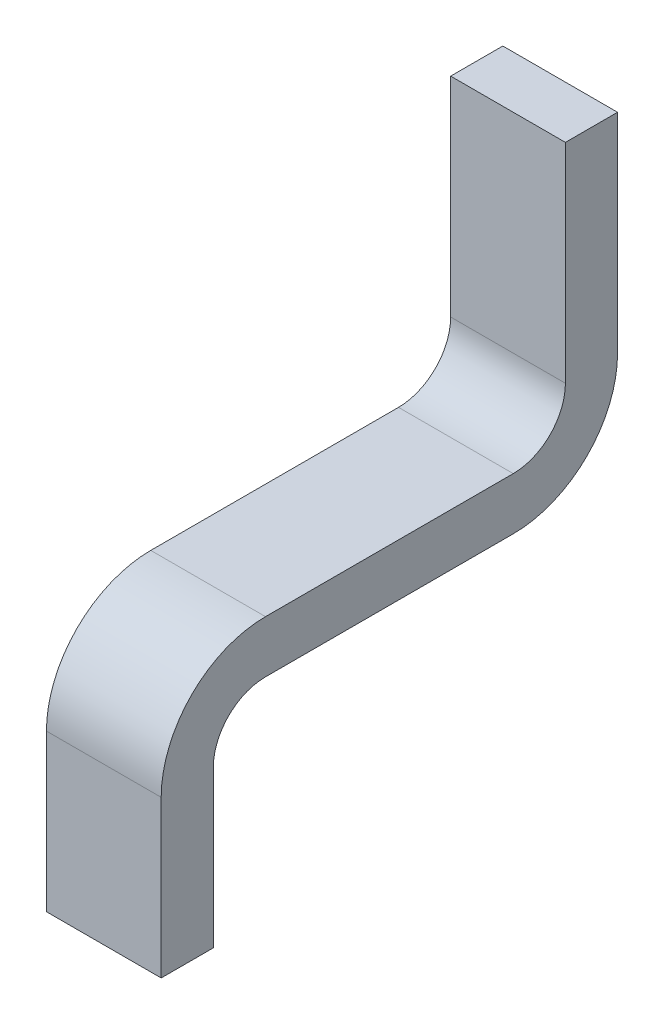
ISO-10303-21;
HEADER;
FILE_DESCRIPTION(('STEP AP214'),'2;1');
FILE_NAME('part.step','',(''),(''),'','','');
FILE_SCHEMA(('AUTOMOTIVE_DESIGN { 1 0 10303 214 1 1 1 1 }'));
ENDSEC;
DATA;
#1=APPLICATION_CONTEXT('core data for automotive mechanical design processes');
#2=APPLICATION_PROTOCOL_DEFINITION('international standard','automotive_design',2000,#1);
#3=PRODUCT_CONTEXT('',#1,'mechanical');
#4=PRODUCT('Part','Part','',(#3));
#5=PRODUCT_RELATED_PRODUCT_CATEGORY('part','',(#4));
#6=PRODUCT_DEFINITION_FORMATION('','',#4);
#7=PRODUCT_DEFINITION_CONTEXT('part definition',#1,'design');
#8=PRODUCT_DEFINITION('design','',#6,#7);
#9=PRODUCT_DEFINITION_SHAPE('','',#8);
#10=(LENGTH_UNIT() NAMED_UNIT(*) SI_UNIT(.MILLI.,.METRE.));
#11=(NAMED_UNIT(*) PLANE_ANGLE_UNIT() SI_UNIT($,.RADIAN.));
#12=(NAMED_UNIT(*) SI_UNIT($,.STERADIAN.) SOLID_ANGLE_UNIT());
#13=UNCERTAINTY_MEASURE_WITH_UNIT(LENGTH_MEASURE(1.E-05),#10,'distance_accuracy_value','');
#14=(GEOMETRIC_REPRESENTATION_CONTEXT(3) GLOBAL_UNCERTAINTY_ASSIGNED_CONTEXT((#13)) GLOBAL_UNIT_ASSIGNED_CONTEXT((#10,
#11,#12)) REPRESENTATION_CONTEXT('',''));
#15=CARTESIAN_POINT('',(0.,0.,0.));
#16=DIRECTION('',(0.,0.,1.));
#17=DIRECTION('',(1.,0.,0.));
#18=AXIS2_PLACEMENT_3D('',#15,#16,#17);
#19=CARTESIAN_POINT('',(0.86,4.,0.675));
#20=DIRECTION('',(-1.,0.,0.));
#21=DIRECTION('',(0.,-1.,0.));
#22=AXIS2_PLACEMENT_3D('',#19,#20,#21);
#23=PLANE('',#22);
#24=CARTESIAN_POINT('',(0.860000000000001,3.8,0.675));
#25=DIRECTION('',(1.,0.,0.));
#26=DIRECTION('',(0.,1.,0.));
#27=AXIS2_PLACEMENT_3D('',#24,#25,#26);
#28=CIRCLE('',#27,0.2);
#29=CARTESIAN_POINT('',(0.860000000000001,3.8,0.875));
#30=VERTEX_POINT('',#29);
#31=CARTESIAN_POINT('',(0.86,4.,0.675));
#32=VERTEX_POINT('',#31);
#33=EDGE_CURVE('E150',#30,#32,#28,.F.);
#34=ORIENTED_EDGE('',*,*,#33,.F.);
#35=DIRECTION('',(0.,1.,0.));
#36=VECTOR('',#35,1.);
#37=CARTESIAN_POINT('',(0.86,3.50000000000001,0.875));
#38=LINE('',#37,#36);
#39=CARTESIAN_POINT('',(0.86,3.50000000000001,0.875));
#40=VERTEX_POINT('',#39);
#41=EDGE_CURVE('E147',#30,#40,#38,.F.);
#42=ORIENTED_EDGE('',*,*,#41,.T.);
#43=DIRECTION('',(0.,0.,1.));
#44=VECTOR('',#43,1.);
#45=CARTESIAN_POINT('',(0.86,3.50000000000001,0.775));
#46=LINE('',#45,#44);
#47=CARTESIAN_POINT('',(0.86,3.50000000000001,0.775));
#48=VERTEX_POINT('',#47);
#49=EDGE_CURVE('E141',#48,#40,#46,.T.);
#50=ORIENTED_EDGE('',*,*,#49,.F.);
#51=DIRECTION('',(0.,1.,0.));
#52=VECTOR('',#51,1.);
#53=CARTESIAN_POINT('',(0.86,3.50000000000001,0.775));
#54=LINE('',#53,#52);
#55=CARTESIAN_POINT('',(0.860000000000001,3.8,0.775));
#56=VERTEX_POINT('',#55);
#57=EDGE_CURVE('E115',#48,#56,#54,.T.);
#58=ORIENTED_EDGE('',*,*,#57,.T.);
#59=CARTESIAN_POINT('',(0.860000000000001,3.8,0.675));
#60=DIRECTION('',(1.,0.,0.));
#61=DIRECTION('',(0.,1.,0.));
#62=AXIS2_PLACEMENT_3D('',#59,#60,#61);
#63=CIRCLE('',#62,0.1);
#64=CARTESIAN_POINT('',(0.860000000000001,3.90000000000001,0.675));
#65=VERTEX_POINT('',#64);
#66=EDGE_CURVE('E215',#56,#65,#63,.F.);
#67=ORIENTED_EDGE('',*,*,#66,.T.);
#68=DIRECTION('',(0.,0.,1.));
#69=VECTOR('',#68,1.);
#70=CARTESIAN_POINT('',(0.860000000000001,3.90000000000001,0.675));
#71=LINE('',#70,#69);
#72=CARTESIAN_POINT('',(0.860000000000001,3.90000000000001,0.2));
#73=VERTEX_POINT('',#72);
#74=EDGE_CURVE('E181',#65,#73,#71,.F.);
#75=ORIENTED_EDGE('',*,*,#74,.T.);
#76=CARTESIAN_POINT('',(0.86,4.1,0.2));
#77=DIRECTION('',(-1.,0.,0.));
#78=DIRECTION('',(0.,-1.,0.));
#79=AXIS2_PLACEMENT_3D('',#76,#77,#78);
#80=CIRCLE('',#79,0.2);
#81=CARTESIAN_POINT('',(0.86,4.1,0.));
#82=VERTEX_POINT('',#81);
#83=EDGE_CURVE('E20',#82,#73,#80,.T.);
#84=ORIENTED_EDGE('',*,*,#83,.F.);
#85=DIRECTION('',(0.,1.,0.));
#86=VECTOR('',#85,1.);
#87=CARTESIAN_POINT('',(0.86,4.1,0.));
#88=LINE('',#87,#86);
#89=CARTESIAN_POINT('',(0.86,4.5,0.));
#90=VERTEX_POINT('',#89);
#91=EDGE_CURVE('E91',#82,#90,#88,.T.);
#92=ORIENTED_EDGE('',*,*,#91,.T.);
#93=DIRECTION('',(0.,0.,1.));
#94=VECTOR('',#93,1.);
#95=CARTESIAN_POINT('',(0.86,4.5,0.));
#96=LINE('',#95,#94);
#97=CARTESIAN_POINT('',(0.86,4.5,0.1));
#98=VERTEX_POINT('',#97);
#99=EDGE_CURVE('E163',#90,#98,#96,.T.);
#100=ORIENTED_EDGE('',*,*,#99,.T.);
#101=DIRECTION('',(0.,1.,0.));
#102=VECTOR('',#101,1.);
#103=CARTESIAN_POINT('',(0.86,4.1,0.1));
#104=LINE('',#103,#102);
#105=CARTESIAN_POINT('',(0.86,4.1,0.1));
#106=VERTEX_POINT('',#105);
#107=EDGE_CURVE('E159',#98,#106,#104,.F.);
#108=ORIENTED_EDGE('',*,*,#107,.T.);
#109=CARTESIAN_POINT('',(0.86,4.1,0.2));
#110=DIRECTION('',(-1.,0.,0.));
#111=DIRECTION('',(0.,-1.,0.));
#112=AXIS2_PLACEMENT_3D('',#109,#110,#111);
#113=CIRCLE('',#112,0.1);
#114=CARTESIAN_POINT('',(0.86,4.,0.2));
#115=VERTEX_POINT('',#114);
#116=EDGE_CURVE('E155',#106,#115,#113,.T.);
#117=ORIENTED_EDGE('',*,*,#116,.T.);
#118=DIRECTION('',(0.,0.,1.));
#119=VECTOR('',#118,1.);
#120=CARTESIAN_POINT('',(0.86,4.,0.675));
#121=LINE('',#120,#119);
#122=EDGE_CURVE('E154',#115,#32,#121,.T.);
#123=ORIENTED_EDGE('',*,*,#122,.T.);
#124=EDGE_LOOP('',(#34,#42,#50,#58,#67,#75,#84,#92,#100,#108,#117,#123));
#125=FACE_BOUND('',#124,.T.);
#126=ADVANCED_FACE('F17',(#125),#23,.F.);
#127=CARTESIAN_POINT('',(0.86,4.1,0.2));
#128=DIRECTION('',(-1.,0.,0.));
#129=DIRECTION('',(0.,-1.,0.));
#130=AXIS2_PLACEMENT_3D('',#127,#128,#129);
#131=CYLINDRICAL_SURFACE('',#130,0.2);
#132=CARTESIAN_POINT('',(0.64,4.1,0.2));
#133=DIRECTION('',(-1.,0.,0.));
#134=DIRECTION('',(0.,-1.,0.));
#135=AXIS2_PLACEMENT_3D('',#132,#133,#134);
#136=CIRCLE('',#135,0.2);
#137=CARTESIAN_POINT('',(0.640000000000001,3.90000000000001,0.2));
#138=VERTEX_POINT('',#137);
#139=CARTESIAN_POINT('',(0.64,4.1,0.));
#140=VERTEX_POINT('',#139);
#141=EDGE_CURVE('E183',#138,#140,#136,.F.);
#142=ORIENTED_EDGE('',*,*,#141,.T.);
#143=DIRECTION('',(1.,0.,0.));
#144=VECTOR('',#143,1.);
#145=CARTESIAN_POINT('',(0.86,4.1,0.));
#146=LINE('',#145,#144);
#147=EDGE_CURVE('E178',#140,#82,#146,.T.);
#148=ORIENTED_EDGE('',*,*,#147,.T.);
#149=ORIENTED_EDGE('',*,*,#83,.T.);
#150=DIRECTION('',(-1.,0.,0.));
#151=VECTOR('',#150,1.);
#152=CARTESIAN_POINT('',(0.860000000000001,3.90000000000001,0.2));
#153=LINE('',#152,#151);
#154=EDGE_CURVE('E217',#73,#138,#153,.T.);
#155=ORIENTED_EDGE('',*,*,#154,.T.);
#156=EDGE_LOOP('',(#142,#148,#149,#155));
#157=FACE_BOUND('',#156,.T.);
#158=ADVANCED_FACE('F254',(#157),#131,.T.);
#159=CARTESIAN_POINT('',(0.86,4.1,0.));
#160=DIRECTION('',(0.,0.,1.));
#161=DIRECTION('',(1.,0.,0.));
#162=AXIS2_PLACEMENT_3D('',#159,#160,#161);
#163=PLANE('',#162);
#164=ORIENTED_EDGE('',*,*,#147,.F.);
#165=DIRECTION('',(0.,1.,0.));
#166=VECTOR('',#165,1.);
#167=CARTESIAN_POINT('',(0.640000000000001,3.90000000000001,0.));
#168=LINE('',#167,#166);
#169=CARTESIAN_POINT('',(0.64,4.5,0.));
#170=VERTEX_POINT('',#169);
#171=EDGE_CURVE('E170',#140,#170,#168,.T.);
#172=ORIENTED_EDGE('',*,*,#171,.T.);
#173=DIRECTION('',(1.,0.,0.));
#174=VECTOR('',#173,1.);
#175=CARTESIAN_POINT('',(0.86,4.5,0.));
#176=LINE('',#175,#174);
#177=EDGE_CURVE('E173',#170,#90,#176,.T.);
#178=ORIENTED_EDGE('',*,*,#177,.T.);
#179=ORIENTED_EDGE('',*,*,#91,.F.);
#180=EDGE_LOOP('',(#164,#172,#178,#179));
#181=FACE_BOUND('',#180,.T.);
#182=ADVANCED_FACE('F257',(#181),#163,.F.);
#183=CARTESIAN_POINT('',(0.86,4.5,0.));
#184=DIRECTION('',(0.,-1.,0.));
#185=DIRECTION('',(1.,0.,0.));
#186=AXIS2_PLACEMENT_3D('',#183,#184,#185);
#187=PLANE('',#186);
#188=DIRECTION('',(-1.,0.,0.));
#189=VECTOR('',#188,1.);
#190=CARTESIAN_POINT('',(0.64,4.5,0.1));
#191=LINE('',#190,#189);
#192=CARTESIAN_POINT('',(0.64,4.5,0.1));
#193=VERTEX_POINT('',#192);
#194=EDGE_CURVE('E160',#193,#98,#191,.F.);
#195=ORIENTED_EDGE('',*,*,#194,.T.);
#196=ORIENTED_EDGE('',*,*,#99,.F.);
#197=ORIENTED_EDGE('',*,*,#177,.F.);
#198=DIRECTION('',(0.,0.,1.));
#199=VECTOR('',#198,1.);
#200=CARTESIAN_POINT('',(0.64,4.5,0.675));
#201=LINE('',#200,#199);
#202=EDGE_CURVE('E166',#170,#193,#201,.T.);
#203=ORIENTED_EDGE('',*,*,#202,.T.);
#204=EDGE_LOOP('',(#195,#196,#197,#203));
#205=FACE_BOUND('',#204,.T.);
#206=ADVANCED_FACE('F259',(#205),#187,.F.);
#207=CARTESIAN_POINT('',(0.64,4.1,0.1));
#208=DIRECTION('',(0.,0.,-1.));
#209=DIRECTION('',(-1.,0.,0.));
#210=AXIS2_PLACEMENT_3D('',#207,#208,#209);
#211=PLANE('',#210);
#212=DIRECTION('',(-1.,0.,0.));
#213=VECTOR('',#212,1.);
#214=CARTESIAN_POINT('',(0.64,4.1,0.1));
#215=LINE('',#214,#213);
#216=CARTESIAN_POINT('',(0.64,4.1,0.1));
#217=VERTEX_POINT('',#216);
#218=EDGE_CURVE('E156',#217,#106,#215,.F.);
#219=ORIENTED_EDGE('',*,*,#218,.T.);
#220=ORIENTED_EDGE('',*,*,#107,.F.);
#221=ORIENTED_EDGE('',*,*,#194,.F.);
#222=DIRECTION('',(0.,1.,0.));
#223=VECTOR('',#222,1.);
#224=CARTESIAN_POINT('',(0.640000000000001,3.90000000000001,0.1));
#225=LINE('',#224,#223);
#226=EDGE_CURVE('E169',#193,#217,#225,.F.);
#227=ORIENTED_EDGE('',*,*,#226,.T.);
#228=EDGE_LOOP('',(#219,#220,#221,#227));
#229=FACE_BOUND('',#228,.T.);
#230=ADVANCED_FACE('F234',(#229),#211,.F.);
#231=CARTESIAN_POINT('',(0.64,4.1,0.2));
#232=DIRECTION('',(-1.,0.,0.));
#233=DIRECTION('',(0.,-1.,0.));
#234=AXIS2_PLACEMENT_3D('',#231,#232,#233);
#235=CYLINDRICAL_SURFACE('',#234,0.1);
#236=DIRECTION('',(1.,0.,0.));
#237=VECTOR('',#236,1.);
#238=CARTESIAN_POINT('',(0.64,4.,0.2));
#239=LINE('',#238,#237);
#240=CARTESIAN_POINT('',(0.64,4.,0.2));
#241=VERTEX_POINT('',#240);
#242=EDGE_CURVE('E151',#241,#115,#239,.T.);
#243=ORIENTED_EDGE('',*,*,#242,.T.);
#244=ORIENTED_EDGE('',*,*,#116,.F.);
#245=ORIENTED_EDGE('',*,*,#218,.F.);
#246=CARTESIAN_POINT('',(0.64,4.1,0.2));
#247=DIRECTION('',(-1.,0.,0.));
#248=DIRECTION('',(0.,-1.,0.));
#249=AXIS2_PLACEMENT_3D('',#246,#247,#248);
#250=CIRCLE('',#249,0.1);
#251=EDGE_CURVE('E210',#217,#241,#250,.T.);
#252=ORIENTED_EDGE('',*,*,#251,.T.);
#253=EDGE_LOOP('',(#243,#244,#245,#252));
#254=FACE_BOUND('',#253,.T.);
#255=ADVANCED_FACE('F227',(#254),#235,.F.);
#256=CARTESIAN_POINT('',(0.64,4.,0.675));
#257=DIRECTION('',(0.,-1.,0.));
#258=DIRECTION('',(1.,0.,0.));
#259=AXIS2_PLACEMENT_3D('',#256,#257,#258);
#260=PLANE('',#259);
#261=DIRECTION('',(1.,0.,0.));
#262=VECTOR('',#261,1.);
#263=CARTESIAN_POINT('',(0.64,4.,0.675));
#264=LINE('',#263,#262);
#265=CARTESIAN_POINT('',(0.64,4.,0.675));
#266=VERTEX_POINT('',#265);
#267=EDGE_CURVE('E148',#32,#266,#264,.F.);
#268=ORIENTED_EDGE('',*,*,#267,.F.);
#269=ORIENTED_EDGE('',*,*,#122,.F.);
#270=ORIENTED_EDGE('',*,*,#242,.F.);
#271=DIRECTION('',(0.,0.,1.));
#272=VECTOR('',#271,1.);
#273=CARTESIAN_POINT('',(0.64,4.,0.675));
#274=LINE('',#273,#272);
#275=EDGE_CURVE('E209',#241,#266,#274,.T.);
#276=ORIENTED_EDGE('',*,*,#275,.T.);
#277=EDGE_LOOP('',(#268,#269,#270,#276));
#278=FACE_BOUND('',#277,.T.);
#279=ADVANCED_FACE('F224',(#278),#260,.F.);
#280=CARTESIAN_POINT('',(0.640000000000001,3.8,0.675));
#281=DIRECTION('',(1.,0.,0.));
#282=DIRECTION('',(0.,1.,0.));
#283=AXIS2_PLACEMENT_3D('',#280,#281,#282);
#284=CYLINDRICAL_SURFACE('',#283,0.2);
#285=ORIENTED_EDGE('',*,*,#33,.T.);
#286=ORIENTED_EDGE('',*,*,#267,.T.);
#287=CARTESIAN_POINT('',(0.640000000000001,3.8,0.675));
#288=DIRECTION('',(1.,0.,0.));
#289=DIRECTION('',(0.,1.,0.));
#290=AXIS2_PLACEMENT_3D('',#287,#288,#289);
#291=CIRCLE('',#290,0.2);
#292=CARTESIAN_POINT('',(0.640000000000001,3.8,0.875));
#293=VERTEX_POINT('',#292);
#294=EDGE_CURVE('E133',#266,#293,#291,.T.);
#295=ORIENTED_EDGE('',*,*,#294,.T.);
#296=DIRECTION('',(-1.,0.,0.));
#297=VECTOR('',#296,1.);
#298=CARTESIAN_POINT('',(0.640000000000001,3.8,0.875));
#299=LINE('',#298,#297);
#300=EDGE_CURVE('E144',#293,#30,#299,.F.);
#301=ORIENTED_EDGE('',*,*,#300,.T.);
#302=EDGE_LOOP('',(#285,#286,#295,#301));
#303=FACE_BOUND('',#302,.T.);
#304=ADVANCED_FACE('F285',(#303),#284,.T.);
#305=CARTESIAN_POINT('',(0.64,3.50000000000001,0.875));
#306=DIRECTION('',(0.,0.,-1.));
#307=DIRECTION('',(-1.,0.,0.));
#308=AXIS2_PLACEMENT_3D('',#305,#306,#307);
#309=PLANE('',#308);
#310=DIRECTION('',(1.,0.,0.));
#311=VECTOR('',#310,1.);
#312=CARTESIAN_POINT('',(0.86,3.50000000000001,0.875));
#313=LINE('',#312,#311);
#314=CARTESIAN_POINT('',(0.64,3.50000000000001,0.875));
#315=VERTEX_POINT('',#314);
#316=EDGE_CURVE('E118',#40,#315,#313,.F.);
#317=ORIENTED_EDGE('',*,*,#316,.F.);
#318=ORIENTED_EDGE('',*,*,#41,.F.);
#319=ORIENTED_EDGE('',*,*,#300,.F.);
#320=DIRECTION('',(0.,1.,0.));
#321=VECTOR('',#320,1.);
#322=CARTESIAN_POINT('',(0.640000000000001,3.90000000000001,0.875));
#323=LINE('',#322,#321);
#324=EDGE_CURVE('E131',#293,#315,#323,.F.);
#325=ORIENTED_EDGE('',*,*,#324,.T.);
#326=EDGE_LOOP('',(#317,#318,#319,#325));
#327=FACE_BOUND('',#326,.T.);
#328=ADVANCED_FACE('F282',(#327),#309,.F.);
#329=CARTESIAN_POINT('',(0.86,3.50000000000001,0.775));
#330=DIRECTION('',(0.,-1.,0.));
#331=DIRECTION('',(1.,0.,0.));
#332=AXIS2_PLACEMENT_3D('',#329,#330,#331);
#333=PLANE('',#332);
#334=ORIENTED_EDGE('',*,*,#49,.T.);
#335=ORIENTED_EDGE('',*,*,#316,.T.);
#336=DIRECTION('',(0.,0.,1.));
#337=VECTOR('',#336,1.);
#338=CARTESIAN_POINT('',(0.64,3.50000000000001,0.675));
#339=LINE('',#338,#337);
#340=CARTESIAN_POINT('',(0.64,3.50000000000001,0.775));
#341=VERTEX_POINT('',#340);
#342=EDGE_CURVE('E125',#315,#341,#339,.F.);
#343=ORIENTED_EDGE('',*,*,#342,.T.);
#344=DIRECTION('',(1.,0.,0.));
#345=VECTOR('',#344,1.);
#346=CARTESIAN_POINT('',(0.86,3.50000000000001,0.775));
#347=LINE('',#346,#345);
#348=EDGE_CURVE('E110',#341,#48,#347,.T.);
#349=ORIENTED_EDGE('',*,*,#348,.T.);
#350=EDGE_LOOP('',(#334,#335,#343,#349));
#351=FACE_BOUND('',#350,.T.);
#352=ADVANCED_FACE('F129',(#351),#333,.T.);
#353=CARTESIAN_POINT('',(0.86,3.50000000000001,0.775));
#354=DIRECTION('',(0.,0.,1.));
#355=DIRECTION('',(1.,0.,0.));
#356=AXIS2_PLACEMENT_3D('',#353,#354,#355);
#357=PLANE('',#356);
#358=ORIENTED_EDGE('',*,*,#348,.F.);
#359=DIRECTION('',(0.,1.,0.));
#360=VECTOR('',#359,1.);
#361=CARTESIAN_POINT('',(0.640000000000001,3.90000000000001,0.775));
#362=LINE('',#361,#360);
#363=CARTESIAN_POINT('',(0.640000000000001,3.8,0.775));
#364=VERTEX_POINT('',#363);
#365=EDGE_CURVE('E114',#341,#364,#362,.T.);
#366=ORIENTED_EDGE('',*,*,#365,.T.);
#367=DIRECTION('',(1.,0.,0.));
#368=VECTOR('',#367,1.);
#369=CARTESIAN_POINT('',(0.860000000000001,3.8,0.775));
#370=LINE('',#369,#368);
#371=EDGE_CURVE('E185',#364,#56,#370,.T.);
#372=ORIENTED_EDGE('',*,*,#371,.T.);
#373=ORIENTED_EDGE('',*,*,#57,.F.);
#374=EDGE_LOOP('',(#358,#366,#372,#373));
#375=FACE_BOUND('',#374,.T.);
#376=ADVANCED_FACE('F112',(#375),#357,.F.);
#377=CARTESIAN_POINT('',(0.860000000000001,3.8,0.675));
#378=DIRECTION('',(1.,0.,0.));
#379=DIRECTION('',(0.,1.,0.));
#380=AXIS2_PLACEMENT_3D('',#377,#378,#379);
#381=CYLINDRICAL_SURFACE('',#380,0.1);
#382=ORIENTED_EDGE('',*,*,#371,.F.);
#383=CARTESIAN_POINT('',(0.640000000000001,3.8,0.675));
#384=DIRECTION('',(1.,0.,0.));
#385=DIRECTION('',(0.,1.,0.));
#386=AXIS2_PLACEMENT_3D('',#383,#384,#385);
#387=CIRCLE('',#386,0.1);
#388=CARTESIAN_POINT('',(0.640000000000001,3.90000000000001,0.675));
#389=VERTEX_POINT('',#388);
#390=EDGE_CURVE('E26',#364,#389,#387,.F.);
#391=ORIENTED_EDGE('',*,*,#390,.T.);
#392=DIRECTION('',(-1.,0.,0.));
#393=VECTOR('',#392,1.);
#394=CARTESIAN_POINT('',(0.860000000000001,3.90000000000001,0.675));
#395=LINE('',#394,#393);
#396=EDGE_CURVE('E34',#389,#65,#395,.F.);
#397=ORIENTED_EDGE('',*,*,#396,.T.);
#398=ORIENTED_EDGE('',*,*,#66,.F.);
#399=EDGE_LOOP('',(#382,#391,#397,#398));
#400=FACE_BOUND('',#399,.T.);
#401=ADVANCED_FACE('F250',(#400),#381,.F.);
#402=CARTESIAN_POINT('',(0.860000000000001,3.90000000000001,0.675));
#403=DIRECTION('',(0.,1.,0.));
#404=DIRECTION('',(-1.,0.,0.));
#405=AXIS2_PLACEMENT_3D('',#402,#403,#404);
#406=PLANE('',#405);
#407=ORIENTED_EDGE('',*,*,#396,.F.);
#408=DIRECTION('',(0.,0.,1.));
#409=VECTOR('',#408,1.);
#410=CARTESIAN_POINT('',(0.640000000000001,3.90000000000001,0.675));
#411=LINE('',#410,#409);
#412=EDGE_CURVE('E11',#389,#138,#411,.F.);
#413=ORIENTED_EDGE('',*,*,#412,.T.);
#414=ORIENTED_EDGE('',*,*,#154,.F.);
#415=ORIENTED_EDGE('',*,*,#74,.F.);
#416=EDGE_LOOP('',(#407,#413,#414,#415));
#417=FACE_BOUND('',#416,.T.);
#418=ADVANCED_FACE('F252',(#417),#406,.F.);
#419=CARTESIAN_POINT('',(0.640000000000001,3.90000000000001,0.675));
#420=DIRECTION('',(1.,0.,0.));
#421=DIRECTION('',(0.,1.,0.));
#422=AXIS2_PLACEMENT_3D('',#419,#420,#421);
#423=PLANE('',#422);
#424=ORIENTED_EDGE('',*,*,#390,.F.);
#425=ORIENTED_EDGE('',*,*,#365,.F.);
#426=ORIENTED_EDGE('',*,*,#342,.F.);
#427=ORIENTED_EDGE('',*,*,#324,.F.);
#428=ORIENTED_EDGE('',*,*,#294,.F.);
#429=ORIENTED_EDGE('',*,*,#275,.F.);
#430=ORIENTED_EDGE('',*,*,#251,.F.);
#431=ORIENTED_EDGE('',*,*,#226,.F.);
#432=ORIENTED_EDGE('',*,*,#202,.F.);
#433=ORIENTED_EDGE('',*,*,#171,.F.);
#434=ORIENTED_EDGE('',*,*,#141,.F.);
#435=ORIENTED_EDGE('',*,*,#412,.F.);
#436=EDGE_LOOP('',(#424,#425,#426,#427,#428,#429,#430,#431,#432,#433,#434,#435));
#437=FACE_BOUND('',#436,.T.);
#438=ADVANCED_FACE('F123',(#437),#423,.F.);
#439=CLOSED_SHELL('',(#126,#158,#182,#206,#230,#255,#279,#304,#328,#352,#376,#401,#418,#438));
#440=MANIFOLD_SOLID_BREP('B1',#439);
#441=ADVANCED_BREP_SHAPE_REPRESENTATION('',(#18,#440),#14);
#442=SHAPE_DEFINITION_REPRESENTATION(#9,#441);
ENDSEC;
END-ISO-10303-21;
